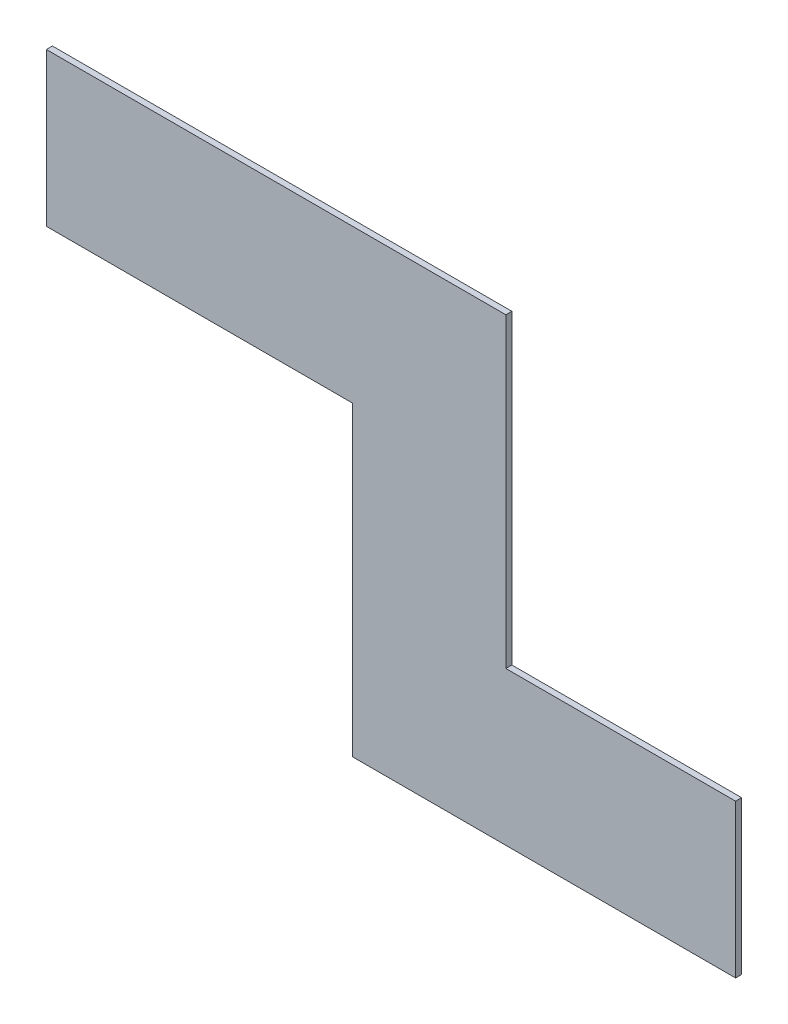
ISO-10303-21;
HEADER;
FILE_DESCRIPTION(('STEP AP214'),'2;1');
FILE_NAME('part.step','',(''),(''),'','','');
FILE_SCHEMA(('AUTOMOTIVE_DESIGN { 1 0 10303 214 1 1 1 1 }'));
ENDSEC;
DATA;
#1=APPLICATION_CONTEXT('core data for automotive mechanical design processes');
#2=APPLICATION_PROTOCOL_DEFINITION('international standard','automotive_design',2000,#1);
#3=PRODUCT_CONTEXT('',#1,'mechanical');
#4=PRODUCT('Part','Part','',(#3));
#5=PRODUCT_RELATED_PRODUCT_CATEGORY('part','',(#4));
#6=PRODUCT_DEFINITION_FORMATION('','',#4);
#7=PRODUCT_DEFINITION_CONTEXT('part definition',#1,'design');
#8=PRODUCT_DEFINITION('design','',#6,#7);
#9=PRODUCT_DEFINITION_SHAPE('','',#8);
#10=(LENGTH_UNIT() NAMED_UNIT(*) SI_UNIT(.MILLI.,.METRE.));
#11=(NAMED_UNIT(*) PLANE_ANGLE_UNIT() SI_UNIT($,.RADIAN.));
#12=(NAMED_UNIT(*) SI_UNIT($,.STERADIAN.) SOLID_ANGLE_UNIT());
#13=UNCERTAINTY_MEASURE_WITH_UNIT(LENGTH_MEASURE(1.E-05),#10,'distance_accuracy_value','');
#14=(GEOMETRIC_REPRESENTATION_CONTEXT(3) GLOBAL_UNCERTAINTY_ASSIGNED_CONTEXT((#13)) GLOBAL_UNIT_ASSIGNED_CONTEXT((#10,
#11,#12)) REPRESENTATION_CONTEXT('',''));
#15=CARTESIAN_POINT('',(0.,0.,0.));
#16=DIRECTION('',(0.,0.,1.));
#17=DIRECTION('',(1.,0.,0.));
#18=AXIS2_PLACEMENT_3D('',#15,#16,#17);
#19=CARTESIAN_POINT('',(0.5715,-0.127,0.));
#20=DIRECTION('',(0.,0.,1.));
#21=DIRECTION('',(1.,0.,0.));
#22=AXIS2_PLACEMENT_3D('',#19,#20,#21);
#23=PLANE('',#22);
#24=DIRECTION('',(0.,1.,0.));
#25=VECTOR('',#24,1.);
#26=CARTESIAN_POINT('',(-0.0635,0.127,0.));
#27=LINE('',#26,#25);
#28=CARTESIAN_POINT('',(-0.0635,-0.381,0.));
#29=VERTEX_POINT('',#28);
#30=CARTESIAN_POINT('',(-0.0635,0.127,0.));
#31=VERTEX_POINT('',#30);
#32=EDGE_CURVE('E120',#29,#31,#27,.T.);
#33=ORIENTED_EDGE('',*,*,#32,.T.);
#34=DIRECTION('',(1.,0.,0.));
#35=VECTOR('',#34,1.);
#36=CARTESIAN_POINT('',(-0.5715,0.127,0.));
#37=LINE('',#36,#35);
#38=CARTESIAN_POINT('',(-0.5715,0.127,0.));
#39=VERTEX_POINT('',#38);
#40=EDGE_CURVE('E116',#31,#39,#37,.F.);
#41=ORIENTED_EDGE('',*,*,#40,.T.);
#42=DIRECTION('',(0.,1.,0.));
#43=VECTOR('',#42,1.);
#44=CARTESIAN_POINT('',(-0.5715,0.381,0.));
#45=LINE('',#44,#43);
#46=CARTESIAN_POINT('',(-0.5715,0.381,0.));
#47=VERTEX_POINT('',#46);
#48=EDGE_CURVE('E112',#39,#47,#45,.T.);
#49=ORIENTED_EDGE('',*,*,#48,.T.);
#50=DIRECTION('',(1.,0.,0.));
#51=VECTOR('',#50,1.);
#52=CARTESIAN_POINT('',(0.1905,0.381,0.));
#53=LINE('',#52,#51);
#54=CARTESIAN_POINT('',(0.1905,0.381,0.));
#55=VERTEX_POINT('',#54);
#56=EDGE_CURVE('E108',#47,#55,#53,.T.);
#57=ORIENTED_EDGE('',*,*,#56,.T.);
#58=DIRECTION('',(0.,1.,0.));
#59=VECTOR('',#58,1.);
#60=CARTESIAN_POINT('',(0.1905,-0.127,0.));
#61=LINE('',#60,#59);
#62=CARTESIAN_POINT('',(0.1905,-0.127,0.));
#63=VERTEX_POINT('',#62);
#64=EDGE_CURVE('E104',#55,#63,#61,.F.);
#65=ORIENTED_EDGE('',*,*,#64,.T.);
#66=DIRECTION('',(1.,0.,0.));
#67=VECTOR('',#66,1.);
#68=CARTESIAN_POINT('',(0.5715,-0.127,0.));
#69=LINE('',#68,#67);
#70=CARTESIAN_POINT('',(0.5715,-0.127,0.));
#71=VERTEX_POINT('',#70);
#72=EDGE_CURVE('E80',#63,#71,#69,.T.);
#73=ORIENTED_EDGE('',*,*,#72,.T.);
#74=DIRECTION('',(0.,1.,0.));
#75=VECTOR('',#74,1.);
#76=CARTESIAN_POINT('',(0.5715,-0.381,0.));
#77=LINE('',#76,#75);
#78=CARTESIAN_POINT('',(0.5715,-0.381,0.));
#79=VERTEX_POINT('',#78);
#80=EDGE_CURVE('E82',#71,#79,#77,.F.);
#81=ORIENTED_EDGE('',*,*,#80,.T.);
#82=DIRECTION('',(1.,0.,0.));
#83=VECTOR('',#82,1.);
#84=CARTESIAN_POINT('',(-0.0635,-0.381,0.));
#85=LINE('',#84,#83);
#86=EDGE_CURVE('E20',#79,#29,#85,.F.);
#87=ORIENTED_EDGE('',*,*,#86,.T.);
#88=EDGE_LOOP('',(#33,#41,#49,#57,#65,#73,#81,#87));
#89=FACE_BOUND('',#88,.T.);
#90=ADVANCED_FACE('F17',(#89),#23,.F.);
#91=CARTESIAN_POINT('',(-0.0635,-0.381,0.));
#92=DIRECTION('',(0.,1.,0.));
#93=DIRECTION('',(0.,0.,1.));
#94=AXIS2_PLACEMENT_3D('',#91,#92,#93);
#95=PLANE('',#94);
#96=DIRECTION('',(1.,0.,0.));
#97=VECTOR('',#96,1.);
#98=CARTESIAN_POINT('',(0.5715,-0.381,0.01));
#99=LINE('',#98,#97);
#100=CARTESIAN_POINT('',(-0.0635,-0.381,0.01));
#101=VERTEX_POINT('',#100);
#102=CARTESIAN_POINT('',(0.5715,-0.381,0.01));
#103=VERTEX_POINT('',#102);
#104=EDGE_CURVE('E124',#101,#103,#99,.T.);
#105=ORIENTED_EDGE('',*,*,#104,.F.);
#106=DIRECTION('',(0.,0.,-1.));
#107=VECTOR('',#106,1.);
#108=CARTESIAN_POINT('',(-0.0635,-0.381,0.));
#109=LINE('',#108,#107);
#110=EDGE_CURVE('E93',#101,#29,#109,.T.);
#111=ORIENTED_EDGE('',*,*,#110,.T.);
#112=ORIENTED_EDGE('',*,*,#86,.F.);
#113=DIRECTION('',(0.,0.,1.));
#114=VECTOR('',#113,1.);
#115=CARTESIAN_POINT('',(0.5715,-0.381,0.));
#116=LINE('',#115,#114);
#117=EDGE_CURVE('E88',#79,#103,#116,.T.);
#118=ORIENTED_EDGE('',*,*,#117,.T.);
#119=EDGE_LOOP('',(#105,#111,#112,#118));
#120=FACE_BOUND('',#119,.T.);
#121=ADVANCED_FACE('F90',(#120),#95,.F.);
#122=CARTESIAN_POINT('',(0.5715,-0.381,0.));
#123=DIRECTION('',(-1.,0.,0.));
#124=DIRECTION('',(0.,0.,1.));
#125=AXIS2_PLACEMENT_3D('',#122,#123,#124);
#126=PLANE('',#125);
#127=DIRECTION('',(0.,1.,0.));
#128=VECTOR('',#127,1.);
#129=CARTESIAN_POINT('',(0.5715,-0.127,0.01));
#130=LINE('',#129,#128);
#131=CARTESIAN_POINT('',(0.5715,-0.127,0.01));
#132=VERTEX_POINT('',#131);
#133=EDGE_CURVE('E97',#103,#132,#130,.T.);
#134=ORIENTED_EDGE('',*,*,#133,.F.);
#135=ORIENTED_EDGE('',*,*,#117,.F.);
#136=ORIENTED_EDGE('',*,*,#80,.F.);
#137=DIRECTION('',(0.,0.,-1.));
#138=VECTOR('',#137,1.);
#139=CARTESIAN_POINT('',(0.5715,-0.127,0.));
#140=LINE('',#139,#138);
#141=EDGE_CURVE('E100',#71,#132,#140,.F.);
#142=ORIENTED_EDGE('',*,*,#141,.T.);
#143=EDGE_LOOP('',(#134,#135,#136,#142));
#144=FACE_BOUND('',#143,.T.);
#145=ADVANCED_FACE('F95',(#144),#126,.F.);
#146=CARTESIAN_POINT('',(0.5715,-0.127,0.));
#147=DIRECTION('',(0.,-1.,0.));
#148=DIRECTION('',(0.,0.,-1.));
#149=AXIS2_PLACEMENT_3D('',#146,#147,#148);
#150=PLANE('',#149);
#151=DIRECTION('',(1.,0.,0.));
#152=VECTOR('',#151,1.);
#153=CARTESIAN_POINT('',(0.5715,-0.127,0.01));
#154=LINE('',#153,#152);
#155=CARTESIAN_POINT('',(0.1905,-0.127,0.01));
#156=VERTEX_POINT('',#155);
#157=EDGE_CURVE('E127',#132,#156,#154,.F.);
#158=ORIENTED_EDGE('',*,*,#157,.F.);
#159=ORIENTED_EDGE('',*,*,#141,.F.);
#160=ORIENTED_EDGE('',*,*,#72,.F.);
#161=DIRECTION('',(0.,0.,1.));
#162=VECTOR('',#161,1.);
#163=CARTESIAN_POINT('',(0.1905,-0.127,0.));
#164=LINE('',#163,#162);
#165=EDGE_CURVE('E106',#63,#156,#164,.T.);
#166=ORIENTED_EDGE('',*,*,#165,.T.);
#167=EDGE_LOOP('',(#158,#159,#160,#166));
#168=FACE_BOUND('',#167,.T.);
#169=ADVANCED_FACE('F161',(#168),#150,.F.);
#170=CARTESIAN_POINT('',(0.1905,-0.127,0.));
#171=DIRECTION('',(-1.,0.,0.));
#172=DIRECTION('',(0.,0.,1.));
#173=AXIS2_PLACEMENT_3D('',#170,#171,#172);
#174=PLANE('',#173);
#175=DIRECTION('',(0.,1.,0.));
#176=VECTOR('',#175,1.);
#177=CARTESIAN_POINT('',(0.1905,-0.127,0.01));
#178=LINE('',#177,#176);
#179=CARTESIAN_POINT('',(0.1905,0.381,0.01));
#180=VERTEX_POINT('',#179);
#181=EDGE_CURVE('E130',#156,#180,#178,.T.);
#182=ORIENTED_EDGE('',*,*,#181,.F.);
#183=ORIENTED_EDGE('',*,*,#165,.F.);
#184=ORIENTED_EDGE('',*,*,#64,.F.);
#185=DIRECTION('',(0.,0.,-1.));
#186=VECTOR('',#185,1.);
#187=CARTESIAN_POINT('',(0.1905,0.381,0.));
#188=LINE('',#187,#186);
#189=EDGE_CURVE('E110',#55,#180,#188,.F.);
#190=ORIENTED_EDGE('',*,*,#189,.T.);
#191=EDGE_LOOP('',(#182,#183,#184,#190));
#192=FACE_BOUND('',#191,.T.);
#193=ADVANCED_FACE('F157',(#192),#174,.F.);
#194=CARTESIAN_POINT('',(0.1905,0.381,0.));
#195=DIRECTION('',(0.,-1.,0.));
#196=DIRECTION('',(0.,0.,-1.));
#197=AXIS2_PLACEMENT_3D('',#194,#195,#196);
#198=PLANE('',#197);
#199=DIRECTION('',(1.,0.,0.));
#200=VECTOR('',#199,1.);
#201=CARTESIAN_POINT('',(0.5715,0.381,0.01));
#202=LINE('',#201,#200);
#203=CARTESIAN_POINT('',(-0.5715,0.381,0.01));
#204=VERTEX_POINT('',#203);
#205=EDGE_CURVE('E133',#180,#204,#202,.F.);
#206=ORIENTED_EDGE('',*,*,#205,.F.);
#207=ORIENTED_EDGE('',*,*,#189,.F.);
#208=ORIENTED_EDGE('',*,*,#56,.F.);
#209=DIRECTION('',(0.,0.,-1.));
#210=VECTOR('',#209,1.);
#211=CARTESIAN_POINT('',(-0.5715,0.381,0.));
#212=LINE('',#211,#210);
#213=EDGE_CURVE('E114',#47,#204,#212,.F.);
#214=ORIENTED_EDGE('',*,*,#213,.T.);
#215=EDGE_LOOP('',(#206,#207,#208,#214));
#216=FACE_BOUND('',#215,.T.);
#217=ADVANCED_FACE('F154',(#216),#198,.F.);
#218=CARTESIAN_POINT('',(-0.5715,0.381,0.));
#219=DIRECTION('',(1.,0.,0.));
#220=DIRECTION('',(0.,0.,-1.));
#221=AXIS2_PLACEMENT_3D('',#218,#219,#220);
#222=PLANE('',#221);
#223=DIRECTION('',(0.,1.,0.));
#224=VECTOR('',#223,1.);
#225=CARTESIAN_POINT('',(-0.5715,-0.127,0.01));
#226=LINE('',#225,#224);
#227=CARTESIAN_POINT('',(-0.5715,0.127,0.01));
#228=VERTEX_POINT('',#227);
#229=EDGE_CURVE('E136',#204,#228,#226,.F.);
#230=ORIENTED_EDGE('',*,*,#229,.F.);
#231=ORIENTED_EDGE('',*,*,#213,.F.);
#232=ORIENTED_EDGE('',*,*,#48,.F.);
#233=DIRECTION('',(0.,0.,1.));
#234=VECTOR('',#233,1.);
#235=CARTESIAN_POINT('',(-0.5715,0.127,0.));
#236=LINE('',#235,#234);
#237=EDGE_CURVE('E118',#39,#228,#236,.T.);
#238=ORIENTED_EDGE('',*,*,#237,.T.);
#239=EDGE_LOOP('',(#230,#231,#232,#238));
#240=FACE_BOUND('',#239,.T.);
#241=ADVANCED_FACE('F147',(#240),#222,.F.);
#242=CARTESIAN_POINT('',(-0.5715,0.127,0.));
#243=DIRECTION('',(0.,1.,0.));
#244=DIRECTION('',(0.,0.,1.));
#245=AXIS2_PLACEMENT_3D('',#242,#243,#244);
#246=PLANE('',#245);
#247=DIRECTION('',(1.,0.,0.));
#248=VECTOR('',#247,1.);
#249=CARTESIAN_POINT('',(0.5715,0.127,0.01));
#250=LINE('',#249,#248);
#251=CARTESIAN_POINT('',(-0.0635,0.127,0.01));
#252=VERTEX_POINT('',#251);
#253=EDGE_CURVE('E26',#228,#252,#250,.T.);
#254=ORIENTED_EDGE('',*,*,#253,.F.);
#255=ORIENTED_EDGE('',*,*,#237,.F.);
#256=ORIENTED_EDGE('',*,*,#40,.F.);
#257=DIRECTION('',(0.,0.,-1.));
#258=VECTOR('',#257,1.);
#259=CARTESIAN_POINT('',(-0.0635,0.127,0.));
#260=LINE('',#259,#258);
#261=EDGE_CURVE('E35',#31,#252,#260,.F.);
#262=ORIENTED_EDGE('',*,*,#261,.T.);
#263=EDGE_LOOP('',(#254,#255,#256,#262));
#264=FACE_BOUND('',#263,.T.);
#265=ADVANCED_FACE('F144',(#264),#246,.F.);
#266=CARTESIAN_POINT('',(-0.0635,0.127,0.));
#267=DIRECTION('',(1.,0.,0.));
#268=DIRECTION('',(0.,0.,-1.));
#269=AXIS2_PLACEMENT_3D('',#266,#267,#268);
#270=PLANE('',#269);
#271=DIRECTION('',(0.,1.,0.));
#272=VECTOR('',#271,1.);
#273=CARTESIAN_POINT('',(-0.0635,-0.127,0.01));
#274=LINE('',#273,#272);
#275=EDGE_CURVE('E11',#252,#101,#274,.F.);
#276=ORIENTED_EDGE('',*,*,#275,.F.);
#277=ORIENTED_EDGE('',*,*,#261,.F.);
#278=ORIENTED_EDGE('',*,*,#32,.F.);
#279=ORIENTED_EDGE('',*,*,#110,.F.);
#280=EDGE_LOOP('',(#276,#277,#278,#279));
#281=FACE_BOUND('',#280,.T.);
#282=ADVANCED_FACE('F163',(#281),#270,.F.);
#283=CARTESIAN_POINT('',(0.5715,-0.127,0.01));
#284=DIRECTION('',(0.,0.,1.));
#285=DIRECTION('',(1.,0.,0.));
#286=AXIS2_PLACEMENT_3D('',#283,#284,#285);
#287=PLANE('',#286);
#288=ORIENTED_EDGE('',*,*,#253,.T.);
#289=ORIENTED_EDGE('',*,*,#275,.T.);
#290=ORIENTED_EDGE('',*,*,#104,.T.);
#291=ORIENTED_EDGE('',*,*,#133,.T.);
#292=ORIENTED_EDGE('',*,*,#157,.T.);
#293=ORIENTED_EDGE('',*,*,#181,.T.);
#294=ORIENTED_EDGE('',*,*,#205,.T.);
#295=ORIENTED_EDGE('',*,*,#229,.T.);
#296=EDGE_LOOP('',(#288,#289,#290,#291,#292,#293,#294,#295));
#297=FACE_BOUND('',#296,.T.);
#298=ADVANCED_FACE('F141',(#297),#287,.T.);
#299=CLOSED_SHELL('',(#90,#121,#145,#169,#193,#217,#241,#265,#282,#298));
#300=MANIFOLD_SOLID_BREP('B1',#299);
#301=ADVANCED_BREP_SHAPE_REPRESENTATION('',(#18,#300),#14);
#302=SHAPE_DEFINITION_REPRESENTATION(#9,#301);
ENDSEC;
END-ISO-10303-21;
